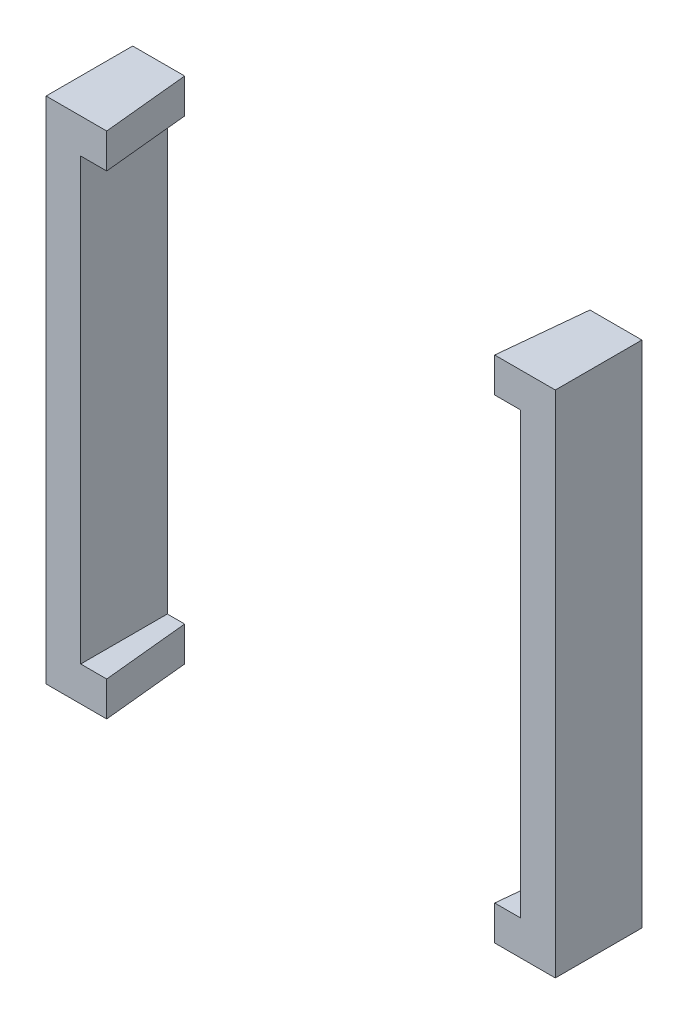
ISO-10303-21;
HEADER;
FILE_DESCRIPTION(('STEP AP214'),'2;1');
FILE_NAME('part.step','',(''),(''),'','','');
FILE_SCHEMA(('AUTOMOTIVE_DESIGN { 1 0 10303 214 1 1 1 1 }'));
ENDSEC;
DATA;
#1=APPLICATION_CONTEXT('core data for automotive mechanical design processes');
#2=APPLICATION_PROTOCOL_DEFINITION('international standard','automotive_design',2000,#1);
#3=PRODUCT_CONTEXT('',#1,'mechanical');
#4=PRODUCT('Part','Part','',(#3));
#5=PRODUCT_RELATED_PRODUCT_CATEGORY('part','',(#4));
#6=PRODUCT_DEFINITION_FORMATION('','',#4);
#7=PRODUCT_DEFINITION_CONTEXT('part definition',#1,'design');
#8=PRODUCT_DEFINITION('design','',#6,#7);
#9=PRODUCT_DEFINITION_SHAPE('','',#8);
#10=(LENGTH_UNIT() NAMED_UNIT(*) SI_UNIT(.MILLI.,.METRE.));
#11=(NAMED_UNIT(*) PLANE_ANGLE_UNIT() SI_UNIT($,.RADIAN.));
#12=(NAMED_UNIT(*) SI_UNIT($,.STERADIAN.) SOLID_ANGLE_UNIT());
#13=UNCERTAINTY_MEASURE_WITH_UNIT(LENGTH_MEASURE(1.E-05),#10,'distance_accuracy_value','');
#14=(GEOMETRIC_REPRESENTATION_CONTEXT(3) GLOBAL_UNCERTAINTY_ASSIGNED_CONTEXT((#13)) GLOBAL_UNIT_ASSIGNED_CONTEXT((#10,
#11,#12)) REPRESENTATION_CONTEXT('',''));
#15=CARTESIAN_POINT('',(0.,0.,0.));
#16=DIRECTION('',(0.,0.,1.));
#17=DIRECTION('',(1.,0.,0.));
#18=AXIS2_PLACEMENT_3D('',#15,#16,#17);
#19=CARTESIAN_POINT('',(0.,0.,5.));
#20=DIRECTION('',(0.,0.,1.));
#21=DIRECTION('',(1.,0.,0.));
#22=AXIS2_PLACEMENT_3D('',#19,#20,#21);
#23=PLANE('',#22);
#24=DIRECTION('',(0.,1.,0.));
#25=VECTOR('',#24,1.);
#26=CARTESIAN_POINT('',(1.5,-2.,5.));
#27=LINE('',#26,#25);
#28=CARTESIAN_POINT('',(1.5,25.4,5.));
#29=VERTEX_POINT('',#28);
#30=CARTESIAN_POINT('',(1.5,27.4,5.));
#31=VERTEX_POINT('',#30);
#32=EDGE_CURVE('E139',#29,#31,#27,.T.);
#33=ORIENTED_EDGE('',*,*,#32,.T.);
#34=DIRECTION('',(-1.,0.,0.));
#35=VECTOR('',#34,1.);
#36=CARTESIAN_POINT('',(0.,27.4,5.));
#37=LINE('',#36,#35);
#38=CARTESIAN_POINT('',(-2.,27.4,5.));
#39=VERTEX_POINT('',#38);
#40=EDGE_CURVE('E148',#31,#39,#37,.T.);
#41=ORIENTED_EDGE('',*,*,#40,.T.);
#42=DIRECTION('',(0.,-1.,0.));
#43=VECTOR('',#42,1.);
#44=CARTESIAN_POINT('',(-2.,0.,5.));
#45=LINE('',#44,#43);
#46=CARTESIAN_POINT('',(-2.,-2.,5.));
#47=VERTEX_POINT('',#46);
#48=EDGE_CURVE('E158',#39,#47,#45,.T.);
#49=ORIENTED_EDGE('',*,*,#48,.T.);
#50=DIRECTION('',(1.,0.,0.));
#51=VECTOR('',#50,1.);
#52=CARTESIAN_POINT('',(0.,-2.,5.));
#53=LINE('',#52,#51);
#54=CARTESIAN_POINT('',(1.5,-2.,5.));
#55=VERTEX_POINT('',#54);
#56=EDGE_CURVE('E160',#47,#55,#53,.T.);
#57=ORIENTED_EDGE('',*,*,#56,.T.);
#58=CARTESIAN_POINT('',(1.5,0.,5.));
#59=VERTEX_POINT('',#58);
#60=EDGE_CURVE('E153',#55,#59,#27,.T.);
#61=ORIENTED_EDGE('',*,*,#60,.T.);
#62=DIRECTION('',(1.,0.,0.));
#63=VECTOR('',#62,1.);
#64=CARTESIAN_POINT('',(0.,0.,5.));
#65=LINE('',#64,#63);
#66=CARTESIAN_POINT('',(0.,0.,5.));
#67=VERTEX_POINT('',#66);
#68=EDGE_CURVE('E176',#67,#59,#65,.T.);
#69=ORIENTED_EDGE('',*,*,#68,.F.);
#70=DIRECTION('',(0.,-1.,0.));
#71=VECTOR('',#70,1.);
#72=CARTESIAN_POINT('',(0.,0.,5.));
#73=LINE('',#72,#71);
#74=CARTESIAN_POINT('',(0.,25.4,5.));
#75=VERTEX_POINT('',#74);
#76=EDGE_CURVE('E168',#75,#67,#73,.T.);
#77=ORIENTED_EDGE('',*,*,#76,.F.);
#78=DIRECTION('',(-1.,0.,0.));
#79=VECTOR('',#78,1.);
#80=CARTESIAN_POINT('',(0.,25.4,5.));
#81=LINE('',#80,#79);
#82=EDGE_CURVE('E151',#29,#75,#81,.T.);
#83=ORIENTED_EDGE('',*,*,#82,.F.);
#84=EDGE_LOOP('',(#33,#41,#49,#57,#61,#69,#77,#83));
#85=FACE_BOUND('',#84,.T.);
#86=ADVANCED_FACE('F75',(#85),#23,.T.);
#87=CARTESIAN_POINT('',(0.,0.,0.));
#88=DIRECTION('',(0.,0.,1.));
#89=DIRECTION('',(1.,0.,0.));
#90=AXIS2_PLACEMENT_3D('',#87,#88,#89);
#91=PLANE('',#90);
#92=DIRECTION('',(-1.,0.,0.));
#93=VECTOR('',#92,1.);
#94=CARTESIAN_POINT('',(0.,27.4,0.));
#95=LINE('',#94,#93);
#96=CARTESIAN_POINT('',(1.,27.4,0.));
#97=VERTEX_POINT('',#96);
#98=CARTESIAN_POINT('',(-2.,27.4,0.));
#99=VERTEX_POINT('',#98);
#100=EDGE_CURVE('E166',#97,#99,#95,.T.);
#101=ORIENTED_EDGE('',*,*,#100,.F.);
#102=DIRECTION('',(0.,1.,0.));
#103=VECTOR('',#102,1.);
#104=CARTESIAN_POINT('',(1.,-2.,0.));
#105=LINE('',#104,#103);
#106=CARTESIAN_POINT('',(1.,25.4,0.));
#107=VERTEX_POINT('',#106);
#108=EDGE_CURVE('E86',#107,#97,#105,.T.);
#109=ORIENTED_EDGE('',*,*,#108,.F.);
#110=DIRECTION('',(-1.,0.,0.));
#111=VECTOR('',#110,1.);
#112=CARTESIAN_POINT('',(0.,25.4,0.));
#113=LINE('',#112,#111);
#114=CARTESIAN_POINT('',(0.,25.4,0.));
#115=VERTEX_POINT('',#114);
#116=EDGE_CURVE('E179',#107,#115,#113,.T.);
#117=ORIENTED_EDGE('',*,*,#116,.T.);
#118=DIRECTION('',(0.,-1.,0.));
#119=VECTOR('',#118,1.);
#120=CARTESIAN_POINT('',(0.,0.,0.));
#121=LINE('',#120,#119);
#122=CARTESIAN_POINT('',(0.,0.,0.));
#123=VERTEX_POINT('',#122);
#124=EDGE_CURVE('E180',#115,#123,#121,.T.);
#125=ORIENTED_EDGE('',*,*,#124,.T.);
#126=DIRECTION('',(1.,0.,0.));
#127=VECTOR('',#126,1.);
#128=CARTESIAN_POINT('',(0.,0.,0.));
#129=LINE('',#128,#127);
#130=CARTESIAN_POINT('',(1.,0.,0.));
#131=VERTEX_POINT('',#130);
#132=EDGE_CURVE('E78',#123,#131,#129,.T.);
#133=ORIENTED_EDGE('',*,*,#132,.T.);
#134=CARTESIAN_POINT('',(1.,-2.,0.));
#135=VERTEX_POINT('',#134);
#136=EDGE_CURVE('E13',#135,#131,#105,.T.);
#137=ORIENTED_EDGE('',*,*,#136,.F.);
#138=DIRECTION('',(1.,0.,0.));
#139=VECTOR('',#138,1.);
#140=CARTESIAN_POINT('',(0.,-2.,0.));
#141=LINE('',#140,#139);
#142=CARTESIAN_POINT('',(-2.,-2.,0.));
#143=VERTEX_POINT('',#142);
#144=EDGE_CURVE('E170',#143,#135,#141,.T.);
#145=ORIENTED_EDGE('',*,*,#144,.F.);
#146=DIRECTION('',(0.,-1.,0.));
#147=VECTOR('',#146,1.);
#148=CARTESIAN_POINT('',(-2.,0.,0.));
#149=LINE('',#148,#147);
#150=EDGE_CURVE('E200',#99,#143,#149,.T.);
#151=ORIENTED_EDGE('',*,*,#150,.F.);
#152=EDGE_LOOP('',(#101,#109,#117,#125,#133,#137,#145,#151));
#153=FACE_BOUND('',#152,.T.);
#154=ADVANCED_FACE('F212',(#153),#91,.F.);
#155=CARTESIAN_POINT('',(-2.,0.,5.));
#156=DIRECTION('',(1.,0.,0.));
#157=DIRECTION('',(0.,0.,-1.));
#158=AXIS2_PLACEMENT_3D('',#155,#156,#157);
#159=PLANE('',#158);
#160=ORIENTED_EDGE('',*,*,#150,.T.);
#161=DIRECTION('',(0.,0.,-1.));
#162=VECTOR('',#161,1.);
#163=CARTESIAN_POINT('',(-2.,-2.,5.));
#164=LINE('',#163,#162);
#165=EDGE_CURVE('E169',#47,#143,#164,.T.);
#166=ORIENTED_EDGE('',*,*,#165,.F.);
#167=ORIENTED_EDGE('',*,*,#48,.F.);
#168=DIRECTION('',(0.,0.,-1.));
#169=VECTOR('',#168,1.);
#170=CARTESIAN_POINT('',(-2.,27.4,5.));
#171=LINE('',#170,#169);
#172=EDGE_CURVE('E156',#39,#99,#171,.T.);
#173=ORIENTED_EDGE('',*,*,#172,.T.);
#174=EDGE_LOOP('',(#160,#166,#167,#173));
#175=FACE_BOUND('',#174,.T.);
#176=ADVANCED_FACE('F217',(#175),#159,.F.);
#177=CARTESIAN_POINT('',(0.,-2.,5.));
#178=DIRECTION('',(0.,1.,0.));
#179=DIRECTION('',(0.,0.,1.));
#180=AXIS2_PLACEMENT_3D('',#177,#178,#179);
#181=PLANE('',#180);
#182=ORIENTED_EDGE('',*,*,#144,.T.);
#183=DIRECTION('',(0.099503719020999,0.,0.995037190209989));
#184=VECTOR('',#183,1.);
#185=CARTESIAN_POINT('',(1.,-2.,0.));
#186=LINE('',#185,#184);
#187=EDGE_CURVE('E173',#135,#55,#186,.T.);
#188=ORIENTED_EDGE('',*,*,#187,.T.);
#189=ORIENTED_EDGE('',*,*,#56,.F.);
#190=ORIENTED_EDGE('',*,*,#165,.T.);
#191=EDGE_LOOP('',(#182,#188,#189,#190));
#192=FACE_BOUND('',#191,.T.);
#193=ADVANCED_FACE('F218',(#192),#181,.F.);
#194=CARTESIAN_POINT('',(0.,27.4,5.));
#195=DIRECTION('',(0.,-1.,0.));
#196=DIRECTION('',(0.,0.,-1.));
#197=AXIS2_PLACEMENT_3D('',#194,#195,#196);
#198=PLANE('',#197);
#199=ORIENTED_EDGE('',*,*,#40,.F.);
#200=DIRECTION('',(0.099503719020999,0.,0.995037190209989));
#201=VECTOR('',#200,1.);
#202=CARTESIAN_POINT('',(1.,27.4,0.));
#203=LINE('',#202,#201);
#204=EDGE_CURVE('E136',#97,#31,#203,.T.);
#205=ORIENTED_EDGE('',*,*,#204,.F.);
#206=ORIENTED_EDGE('',*,*,#100,.T.);
#207=ORIENTED_EDGE('',*,*,#172,.F.);
#208=EDGE_LOOP('',(#199,#205,#206,#207));
#209=FACE_BOUND('',#208,.T.);
#210=ADVANCED_FACE('F154',(#209),#198,.F.);
#211=CARTESIAN_POINT('',(0.,0.,5.));
#212=DIRECTION('',(1.,0.,0.));
#213=DIRECTION('',(0.,0.,-1.));
#214=AXIS2_PLACEMENT_3D('',#211,#212,#213);
#215=PLANE('',#214);
#216=ORIENTED_EDGE('',*,*,#124,.F.);
#217=DIRECTION('',(0.,0.,-1.));
#218=VECTOR('',#217,1.);
#219=CARTESIAN_POINT('',(0.,25.4,5.));
#220=LINE('',#219,#218);
#221=EDGE_CURVE('E175',#75,#115,#220,.T.);
#222=ORIENTED_EDGE('',*,*,#221,.F.);
#223=ORIENTED_EDGE('',*,*,#76,.T.);
#224=DIRECTION('',(0.,0.,-1.));
#225=VECTOR('',#224,1.);
#226=CARTESIAN_POINT('',(0.,0.,5.));
#227=LINE('',#226,#225);
#228=EDGE_CURVE('E178',#67,#123,#227,.T.);
#229=ORIENTED_EDGE('',*,*,#228,.T.);
#230=EDGE_LOOP('',(#216,#222,#223,#229));
#231=FACE_BOUND('',#230,.T.);
#232=ADVANCED_FACE('F208',(#231),#215,.T.);
#233=CARTESIAN_POINT('',(0.,0.,5.));
#234=DIRECTION('',(0.,1.,0.));
#235=DIRECTION('',(0.,0.,1.));
#236=AXIS2_PLACEMENT_3D('',#233,#234,#235);
#237=PLANE('',#236);
#238=DIRECTION('',(0.0995037190209991,0.,0.995037190209989));
#239=VECTOR('',#238,1.);
#240=CARTESIAN_POINT('',(1.48514851485149,0.,4.85148514851485));
#241=LINE('',#240,#239);
#242=EDGE_CURVE('E84',#131,#59,#241,.T.);
#243=ORIENTED_EDGE('',*,*,#242,.F.);
#244=ORIENTED_EDGE('',*,*,#132,.F.);
#245=ORIENTED_EDGE('',*,*,#228,.F.);
#246=ORIENTED_EDGE('',*,*,#68,.T.);
#247=EDGE_LOOP('',(#243,#244,#245,#246));
#248=FACE_BOUND('',#247,.T.);
#249=ADVANCED_FACE('F210',(#248),#237,.T.);
#250=CARTESIAN_POINT('',(0.,25.4,5.));
#251=DIRECTION('',(0.,-1.,0.));
#252=DIRECTION('',(0.,0.,-1.));
#253=AXIS2_PLACEMENT_3D('',#250,#251,#252);
#254=PLANE('',#253);
#255=DIRECTION('',(-0.0995037190209991,0.,-0.995037190209989));
#256=VECTOR('',#255,1.);
#257=CARTESIAN_POINT('',(1.48514851485149,25.4,4.85148514851485));
#258=LINE('',#257,#256);
#259=EDGE_CURVE('E198',#29,#107,#258,.T.);
#260=ORIENTED_EDGE('',*,*,#259,.F.);
#261=ORIENTED_EDGE('',*,*,#82,.T.);
#262=ORIENTED_EDGE('',*,*,#221,.T.);
#263=ORIENTED_EDGE('',*,*,#116,.F.);
#264=EDGE_LOOP('',(#260,#261,#262,#263));
#265=FACE_BOUND('',#264,.T.);
#266=ADVANCED_FACE('F214',(#265),#254,.T.);
#267=CARTESIAN_POINT('',(1.,-2.,0.));
#268=DIRECTION('',(-0.995037190209989,0.,0.099503719020999));
#269=DIRECTION('',(0.0995037190209991,0.,0.995037190209989));
#270=AXIS2_PLACEMENT_3D('',#267,#268,#269);
#271=PLANE('',#270);
#272=ORIENTED_EDGE('',*,*,#259,.T.);
#273=ORIENTED_EDGE('',*,*,#108,.T.);
#274=ORIENTED_EDGE('',*,*,#204,.T.);
#275=ORIENTED_EDGE('',*,*,#32,.F.);
#276=EDGE_LOOP('',(#272,#273,#274,#275));
#277=FACE_BOUND('',#276,.T.);
#278=ADVANCED_FACE('F138',(#277),#271,.F.);
#279=ORIENTED_EDGE('',*,*,#242,.T.);
#280=ORIENTED_EDGE('',*,*,#60,.F.);
#281=ORIENTED_EDGE('',*,*,#187,.F.);
#282=ORIENTED_EDGE('',*,*,#136,.T.);
#283=EDGE_LOOP('',(#279,#280,#281,#282));
#284=FACE_BOUND('',#283,.T.);
#285=ADVANCED_FACE('F286',(#284),#271,.F.);
#286=CLOSED_SHELL('',(#86,#154,#176,#193,#210,#232,#249,#266,#278,#285));
#287=MANIFOLD_SOLID_BREP('B2',#286);
#288=CARTESIAN_POINT('',(27.4,0.,5.));
#289=DIRECTION('',(-1.,0.,0.));
#290=DIRECTION('',(0.,0.,1.));
#291=AXIS2_PLACEMENT_3D('',#288,#289,#290);
#292=PLANE('',#291);
#293=DIRECTION('',(0.,1.,0.));
#294=VECTOR('',#293,1.);
#295=CARTESIAN_POINT('',(27.4,0.,0.));
#296=LINE('',#295,#294);
#297=CARTESIAN_POINT('',(27.4,-2.,0.));
#298=VERTEX_POINT('',#297);
#299=CARTESIAN_POINT('',(27.4,27.4,0.));
#300=VERTEX_POINT('',#299);
#301=EDGE_CURVE('E414',#298,#300,#296,.T.);
#302=ORIENTED_EDGE('',*,*,#301,.T.);
#303=DIRECTION('',(0.,0.,-1.));
#304=VECTOR('',#303,1.);
#305=CARTESIAN_POINT('',(27.4,27.4,5.));
#306=LINE('',#305,#304);
#307=CARTESIAN_POINT('',(27.4,27.4,5.));
#308=VERTEX_POINT('',#307);
#309=EDGE_CURVE('E405',#308,#300,#306,.T.);
#310=ORIENTED_EDGE('',*,*,#309,.F.);
#311=DIRECTION('',(0.,1.,0.));
#312=VECTOR('',#311,1.);
#313=CARTESIAN_POINT('',(27.4,0.,5.));
#314=LINE('',#313,#312);
#315=CARTESIAN_POINT('',(27.4,-2.,5.));
#316=VERTEX_POINT('',#315);
#317=EDGE_CURVE('E403',#316,#308,#314,.T.);
#318=ORIENTED_EDGE('',*,*,#317,.F.);
#319=DIRECTION('',(0.,0.,-1.));
#320=VECTOR('',#319,1.);
#321=CARTESIAN_POINT('',(27.4,-2.,5.));
#322=LINE('',#321,#320);
#323=EDGE_CURVE('E328',#316,#298,#322,.T.);
#324=ORIENTED_EDGE('',*,*,#323,.T.);
#325=EDGE_LOOP('',(#302,#310,#318,#324));
#326=FACE_BOUND('',#325,.T.);
#327=ADVANCED_FACE('F320',(#326),#292,.F.);
#328=CARTESIAN_POINT('',(25.4,0.,5.));
#329=DIRECTION('',(-1.,0.,0.));
#330=DIRECTION('',(0.,0.,1.));
#331=AXIS2_PLACEMENT_3D('',#328,#329,#330);
#332=PLANE('',#331);
#333=DIRECTION('',(0.,1.,0.));
#334=VECTOR('',#333,1.);
#335=CARTESIAN_POINT('',(25.4,0.,0.));
#336=LINE('',#335,#334);
#337=CARTESIAN_POINT('',(25.4,0.,0.));
#338=VERTEX_POINT('',#337);
#339=CARTESIAN_POINT('',(25.4,25.4,0.));
#340=VERTEX_POINT('',#339);
#341=EDGE_CURVE('E447',#338,#340,#336,.T.);
#342=ORIENTED_EDGE('',*,*,#341,.F.);
#343=DIRECTION('',(0.,0.,-1.));
#344=VECTOR('',#343,1.);
#345=CARTESIAN_POINT('',(25.4,0.,5.));
#346=LINE('',#345,#344);
#347=CARTESIAN_POINT('',(25.4,0.,5.));
#348=VERTEX_POINT('',#347);
#349=EDGE_CURVE('E415',#348,#338,#346,.T.);
#350=ORIENTED_EDGE('',*,*,#349,.F.);
#351=DIRECTION('',(0.,1.,0.));
#352=VECTOR('',#351,1.);
#353=CARTESIAN_POINT('',(25.4,0.,5.));
#354=LINE('',#353,#352);
#355=CARTESIAN_POINT('',(25.4,25.4,5.));
#356=VERTEX_POINT('',#355);
#357=EDGE_CURVE('E440',#348,#356,#354,.T.);
#358=ORIENTED_EDGE('',*,*,#357,.T.);
#359=DIRECTION('',(0.,0.,-1.));
#360=VECTOR('',#359,1.);
#361=CARTESIAN_POINT('',(25.4,25.4,5.));
#362=LINE('',#361,#360);
#363=EDGE_CURVE('E445',#356,#340,#362,.T.);
#364=ORIENTED_EDGE('',*,*,#363,.T.);
#365=EDGE_LOOP('',(#342,#350,#358,#364));
#366=FACE_BOUND('',#365,.T.);
#367=ADVANCED_FACE('F462',(#366),#332,.T.);
#368=CARTESIAN_POINT('',(0.,25.4,5.));
#369=DIRECTION('',(0.,-1.,0.));
#370=DIRECTION('',(0.,0.,-1.));
#371=AXIS2_PLACEMENT_3D('',#368,#369,#370);
#372=PLANE('',#371);
#373=DIRECTION('',(-1.,0.,0.));
#374=VECTOR('',#373,1.);
#375=CARTESIAN_POINT('',(0.,25.4,5.));
#376=LINE('',#375,#374);
#377=CARTESIAN_POINT('',(23.9,25.4,5.));
#378=VERTEX_POINT('',#377);
#379=EDGE_CURVE('E443',#356,#378,#376,.T.);
#380=ORIENTED_EDGE('',*,*,#379,.T.);
#381=DIRECTION('',(0.0995037190209985,0.,-0.995037190209989));
#382=VECTOR('',#381,1.);
#383=CARTESIAN_POINT('',(23.6633663366337,25.4,7.36633663366336));
#384=LINE('',#383,#382);
#385=CARTESIAN_POINT('',(24.4,25.4,0.));
#386=VERTEX_POINT('',#385);
#387=EDGE_CURVE('E73',#378,#386,#384,.T.);
#388=ORIENTED_EDGE('',*,*,#387,.T.);
#389=DIRECTION('',(-1.,0.,0.));
#390=VECTOR('',#389,1.);
#391=CARTESIAN_POINT('',(0.,25.4,0.));
#392=LINE('',#391,#390);
#393=EDGE_CURVE('E430',#340,#386,#392,.T.);
#394=ORIENTED_EDGE('',*,*,#393,.F.);
#395=ORIENTED_EDGE('',*,*,#363,.F.);
#396=EDGE_LOOP('',(#380,#388,#394,#395));
#397=FACE_BOUND('',#396,.T.);
#398=ADVANCED_FACE('F464',(#397),#372,.T.);
#399=CARTESIAN_POINT('',(0.,0.,5.));
#400=DIRECTION('',(0.,1.,0.));
#401=DIRECTION('',(0.,0.,1.));
#402=AXIS2_PLACEMENT_3D('',#399,#400,#401);
#403=PLANE('',#402);
#404=DIRECTION('',(1.,0.,0.));
#405=VECTOR('',#404,1.);
#406=CARTESIAN_POINT('',(0.,0.,0.));
#407=LINE('',#406,#405);
#408=CARTESIAN_POINT('',(24.4,0.,0.));
#409=VERTEX_POINT('',#408);
#410=EDGE_CURVE('E437',#409,#338,#407,.T.);
#411=ORIENTED_EDGE('',*,*,#410,.F.);
#412=DIRECTION('',(-0.0995037190209985,0.,0.995037190209989));
#413=VECTOR('',#412,1.);
#414=CARTESIAN_POINT('',(23.6633663366337,0.,7.36633663366336));
#415=LINE('',#414,#413);
#416=CARTESIAN_POINT('',(23.9,0.,5.));
#417=VERTEX_POINT('',#416);
#418=EDGE_CURVE('E433',#409,#417,#415,.T.);
#419=ORIENTED_EDGE('',*,*,#418,.T.);
#420=DIRECTION('',(1.,0.,0.));
#421=VECTOR('',#420,1.);
#422=CARTESIAN_POINT('',(0.,0.,5.));
#423=LINE('',#422,#421);
#424=EDGE_CURVE('E438',#417,#348,#423,.T.);
#425=ORIENTED_EDGE('',*,*,#424,.T.);
#426=ORIENTED_EDGE('',*,*,#349,.T.);
#427=EDGE_LOOP('',(#411,#419,#425,#426));
#428=FACE_BOUND('',#427,.T.);
#429=ADVANCED_FACE('F457',(#428),#403,.T.);
#430=CARTESIAN_POINT('',(0.,-2.,5.));
#431=DIRECTION('',(0.,1.,0.));
#432=DIRECTION('',(0.,0.,1.));
#433=AXIS2_PLACEMENT_3D('',#430,#431,#432);
#434=PLANE('',#433);
#435=DIRECTION('',(-0.0995037190209985,0.,0.995037190209989));
#436=VECTOR('',#435,1.);
#437=CARTESIAN_POINT('',(24.4,-2.,0.));
#438=LINE('',#437,#436);
#439=CARTESIAN_POINT('',(24.4,-2.,0.));
#440=VERTEX_POINT('',#439);
#441=CARTESIAN_POINT('',(23.9,-2.,5.));
#442=VERTEX_POINT('',#441);
#443=EDGE_CURVE('E390',#440,#442,#438,.T.);
#444=ORIENTED_EDGE('',*,*,#443,.F.);
#445=DIRECTION('',(1.,0.,0.));
#446=VECTOR('',#445,1.);
#447=CARTESIAN_POINT('',(0.,-2.,0.));
#448=LINE('',#447,#446);
#449=EDGE_CURVE('E412',#440,#298,#448,.T.);
#450=ORIENTED_EDGE('',*,*,#449,.T.);
#451=ORIENTED_EDGE('',*,*,#323,.F.);
#452=DIRECTION('',(1.,0.,0.));
#453=VECTOR('',#452,1.);
#454=CARTESIAN_POINT('',(0.,-2.,5.));
#455=LINE('',#454,#453);
#456=EDGE_CURVE('E408',#442,#316,#455,.T.);
#457=ORIENTED_EDGE('',*,*,#456,.F.);
#458=EDGE_LOOP('',(#444,#450,#451,#457));
#459=FACE_BOUND('',#458,.T.);
#460=ADVANCED_FACE('F322',(#459),#434,.F.);
#461=CARTESIAN_POINT('',(0.,27.4,5.));
#462=DIRECTION('',(0.,-1.,0.));
#463=DIRECTION('',(0.,0.,-1.));
#464=AXIS2_PLACEMENT_3D('',#461,#462,#463);
#465=PLANE('',#464);
#466=DIRECTION('',(-0.0995037190209985,0.,0.995037190209989));
#467=VECTOR('',#466,1.);
#468=CARTESIAN_POINT('',(24.4,27.4,0.));
#469=LINE('',#468,#467);
#470=CARTESIAN_POINT('',(24.4,27.4,0.));
#471=VERTEX_POINT('',#470);
#472=CARTESIAN_POINT('',(23.9,27.4,5.));
#473=VERTEX_POINT('',#472);
#474=EDGE_CURVE('E385',#471,#473,#469,.T.);
#475=ORIENTED_EDGE('',*,*,#474,.T.);
#476=DIRECTION('',(-1.,0.,0.));
#477=VECTOR('',#476,1.);
#478=CARTESIAN_POINT('',(0.,27.4,5.));
#479=LINE('',#478,#477);
#480=EDGE_CURVE('E397',#308,#473,#479,.T.);
#481=ORIENTED_EDGE('',*,*,#480,.F.);
#482=ORIENTED_EDGE('',*,*,#309,.T.);
#483=DIRECTION('',(-1.,0.,0.));
#484=VECTOR('',#483,1.);
#485=CARTESIAN_POINT('',(0.,27.4,0.));
#486=LINE('',#485,#484);
#487=EDGE_CURVE('E399',#300,#471,#486,.T.);
#488=ORIENTED_EDGE('',*,*,#487,.T.);
#489=EDGE_LOOP('',(#475,#481,#482,#488));
#490=FACE_BOUND('',#489,.T.);
#491=ADVANCED_FACE('F395',(#490),#465,.F.);
#492=CARTESIAN_POINT('',(0.,0.,0.));
#493=DIRECTION('',(0.,0.,1.));
#494=DIRECTION('',(1.,0.,0.));
#495=AXIS2_PLACEMENT_3D('',#492,#493,#494);
#496=PLANE('',#495);
#497=DIRECTION('',(0.,1.,0.));
#498=VECTOR('',#497,1.);
#499=CARTESIAN_POINT('',(24.4,-2.,0.));
#500=LINE('',#499,#498);
#501=EDGE_CURVE('E343',#386,#471,#500,.T.);
#502=ORIENTED_EDGE('',*,*,#501,.T.);
#503=ORIENTED_EDGE('',*,*,#487,.F.);
#504=ORIENTED_EDGE('',*,*,#301,.F.);
#505=ORIENTED_EDGE('',*,*,#449,.F.);
#506=EDGE_CURVE('E431',#440,#409,#500,.T.);
#507=ORIENTED_EDGE('',*,*,#506,.T.);
#508=ORIENTED_EDGE('',*,*,#410,.T.);
#509=ORIENTED_EDGE('',*,*,#341,.T.);
#510=ORIENTED_EDGE('',*,*,#393,.T.);
#511=EDGE_LOOP('',(#502,#503,#504,#505,#507,#508,#509,#510));
#512=FACE_BOUND('',#511,.T.);
#513=ADVANCED_FACE('F425',(#512),#496,.F.);
#514=CARTESIAN_POINT('',(0.,0.,5.));
#515=DIRECTION('',(0.,0.,1.));
#516=DIRECTION('',(1.,0.,0.));
#517=AXIS2_PLACEMENT_3D('',#514,#515,#516);
#518=PLANE('',#517);
#519=ORIENTED_EDGE('',*,*,#480,.T.);
#520=DIRECTION('',(0.,1.,0.));
#521=VECTOR('',#520,1.);
#522=CARTESIAN_POINT('',(23.9,-2.,5.));
#523=LINE('',#522,#521);
#524=EDGE_CURVE('E382',#378,#473,#523,.T.);
#525=ORIENTED_EDGE('',*,*,#524,.F.);
#526=ORIENTED_EDGE('',*,*,#379,.F.);
#527=ORIENTED_EDGE('',*,*,#357,.F.);
#528=ORIENTED_EDGE('',*,*,#424,.F.);
#529=EDGE_CURVE('E335',#442,#417,#523,.T.);
#530=ORIENTED_EDGE('',*,*,#529,.F.);
#531=ORIENTED_EDGE('',*,*,#456,.T.);
#532=ORIENTED_EDGE('',*,*,#317,.T.);
#533=EDGE_LOOP('',(#519,#525,#526,#527,#528,#530,#531,#532));
#534=FACE_BOUND('',#533,.T.);
#535=ADVANCED_FACE('F401',(#534),#518,.T.);
#536=CARTESIAN_POINT('',(24.4,-2.,0.));
#537=DIRECTION('',(-0.995037190209989,0.,-0.0995037190209985));
#538=DIRECTION('',(-0.0995037190209985,0.,0.995037190209989));
#539=AXIS2_PLACEMENT_3D('',#536,#537,#538);
#540=PLANE('',#539);
#541=ORIENTED_EDGE('',*,*,#524,.T.);
#542=ORIENTED_EDGE('',*,*,#474,.F.);
#543=ORIENTED_EDGE('',*,*,#501,.F.);
#544=ORIENTED_EDGE('',*,*,#387,.F.);
#545=EDGE_LOOP('',(#541,#542,#543,#544));
#546=FACE_BOUND('',#545,.T.);
#547=ADVANCED_FACE('F384',(#546),#540,.T.);
#548=ORIENTED_EDGE('',*,*,#506,.F.);
#549=ORIENTED_EDGE('',*,*,#443,.T.);
#550=ORIENTED_EDGE('',*,*,#529,.T.);
#551=ORIENTED_EDGE('',*,*,#418,.F.);
#552=EDGE_LOOP('',(#548,#549,#550,#551));
#553=FACE_BOUND('',#552,.T.);
#554=ADVANCED_FACE('F454',(#553),#540,.T.);
#555=CLOSED_SHELL('',(#327,#367,#398,#429,#460,#491,#513,#535,#547,#554));
#556=MANIFOLD_SOLID_BREP('B7',#555);
#557=ADVANCED_BREP_SHAPE_REPRESENTATION('',(#18,#287,#556),#14);
#558=SHAPE_DEFINITION_REPRESENTATION(#9,#557);
ENDSEC;
END-ISO-10303-21;
